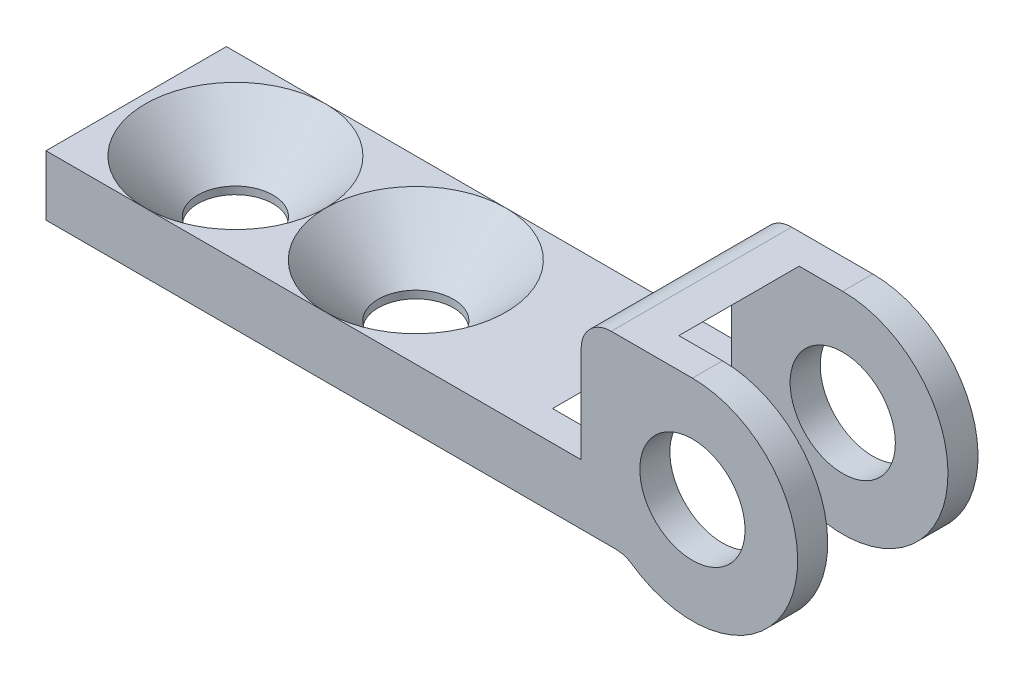
ISO-10303-21;
HEADER;
FILE_DESCRIPTION(('STEP AP214'),'2;1');
FILE_NAME('part.step','',(''),(''),'','','');
FILE_SCHEMA(('AUTOMOTIVE_DESIGN { 1 0 10303 214 1 1 1 1 }'));
ENDSEC;
DATA;
#1=APPLICATION_CONTEXT('core data for automotive mechanical design processes');
#2=APPLICATION_PROTOCOL_DEFINITION('international standard','automotive_design',2000,#1);
#3=PRODUCT_CONTEXT('',#1,'mechanical');
#4=PRODUCT('Part','Part','',(#3));
#5=PRODUCT_RELATED_PRODUCT_CATEGORY('part','',(#4));
#6=PRODUCT_DEFINITION_FORMATION('','',#4);
#7=PRODUCT_DEFINITION_CONTEXT('part definition',#1,'design');
#8=PRODUCT_DEFINITION('design','',#6,#7);
#9=PRODUCT_DEFINITION_SHAPE('','',#8);
#10=(LENGTH_UNIT() NAMED_UNIT(*) SI_UNIT(.MILLI.,.METRE.));
#11=(NAMED_UNIT(*) PLANE_ANGLE_UNIT() SI_UNIT($,.RADIAN.));
#12=(NAMED_UNIT(*) SI_UNIT($,.STERADIAN.) SOLID_ANGLE_UNIT());
#13=UNCERTAINTY_MEASURE_WITH_UNIT(LENGTH_MEASURE(1.E-05),#10,'distance_accuracy_value','');
#14=(GEOMETRIC_REPRESENTATION_CONTEXT(3) GLOBAL_UNCERTAINTY_ASSIGNED_CONTEXT((#13)) GLOBAL_UNIT_ASSIGNED_CONTEXT((#10,
#11,#12)) REPRESENTATION_CONTEXT('',''));
#15=CARTESIAN_POINT('',(0.,0.,0.));
#16=DIRECTION('',(0.,0.,1.));
#17=DIRECTION('',(1.,0.,0.));
#18=AXIS2_PLACEMENT_3D('',#15,#16,#17);
#19=CARTESIAN_POINT('',(0.86993036691125,6.15104880777221,1.5));
#20=DIRECTION('',(0.,0.,1.));
#21=DIRECTION('',(1.,0.,0.));
#22=AXIS2_PLACEMENT_3D('',#19,#20,#21);
#23=CYLINDRICAL_SURFACE('',#22,1.);
#24=CARTESIAN_POINT('',(0.86993036691125,6.15104880777221,-3.));
#25=DIRECTION('',(0.,0.,1.));
#26=DIRECTION('',(1.,0.,0.));
#27=AXIS2_PLACEMENT_3D('',#24,#25,#26);
#28=CIRCLE('',#27,1.);
#29=CARTESIAN_POINT('',(0.86993036691125,7.15104880777221,-3.));
#30=VERTEX_POINT('',#29);
#31=CARTESIAN_POINT('',(-0.13006963308875,6.15104880777221,-3.));
#32=VERTEX_POINT('',#31);
#33=EDGE_CURVE('E161',#30,#32,#28,.T.);
#34=ORIENTED_EDGE('',*,*,#33,.T.);
#35=DIRECTION('',(0.,0.,-1.));
#36=VECTOR('',#35,1.);
#37=CARTESIAN_POINT('',(-0.13006963308875,6.15104880777221,3.));
#38=LINE('',#37,#36);
#39=CARTESIAN_POINT('',(-0.13006963308875,6.15104880777221,3.));
#40=VERTEX_POINT('',#39);
#41=EDGE_CURVE('E159',#32,#40,#38,.F.);
#42=ORIENTED_EDGE('',*,*,#41,.T.);
#43=CARTESIAN_POINT('',(0.86993036691125,6.15104880777221,3.));
#44=DIRECTION('',(0.,0.,1.));
#45=DIRECTION('',(1.,0.,0.));
#46=AXIS2_PLACEMENT_3D('',#43,#44,#45);
#47=CIRCLE('',#46,1.);
#48=CARTESIAN_POINT('',(0.86993036691125,7.15104880777221,3.));
#49=VERTEX_POINT('',#48);
#50=EDGE_CURVE('E20',#40,#49,#47,.F.);
#51=ORIENTED_EDGE('',*,*,#50,.T.);
#52=DIRECTION('',(0.,0.,1.));
#53=VECTOR('',#52,1.);
#54=CARTESIAN_POINT('',(0.86993036691125,7.15104880777221,0.));
#55=LINE('',#54,#53);
#56=EDGE_CURVE('E156',#30,#49,#55,.T.);
#57=ORIENTED_EDGE('',*,*,#56,.F.);
#58=EDGE_LOOP('',(#34,#42,#51,#57));
#59=FACE_BOUND('',#58,.T.);
#60=ADVANCED_FACE('F17',(#59),#23,.T.);
#61=CARTESIAN_POINT('',(-4.49303683807458,1.55104880777221,-0.7));
#62=DIRECTION('',(0.,1.,0.));
#63=DIRECTION('',(-1.,0.,0.));
#64=AXIS2_PLACEMENT_3D('',#61,#62,#63);
#65=PLANE('',#64);
#66=DIRECTION('',(1.,0.,0.));
#67=VECTOR('',#66,1.);
#68=CARTESIAN_POINT('',(-2.525276673201,1.55104880777221,-0.4));
#69=LINE('',#68,#67);
#70=CARTESIAN_POINT('',(-3.47981710139458,1.55104880777221,-0.4));
#71=VERTEX_POINT('',#70);
#72=CARTESIAN_POINT('',(-6.27981710139458,1.55104880777221,-0.4));
#73=VERTEX_POINT('',#72);
#74=EDGE_CURVE('E218',#71,#73,#69,.F.);
#75=ORIENTED_EDGE('',*,*,#74,.T.);
#76=CARTESIAN_POINT('',(-6.27981710139458,1.55104880777221,-0.7));
#77=DIRECTION('',(0.,1.,0.));
#78=DIRECTION('',(0.,0.,1.));
#79=AXIS2_PLACEMENT_3D('',#76,#77,#78);
#80=CIRCLE('',#79,0.3);
#81=CARTESIAN_POINT('',(-6.27981710139458,1.55104880777221,-1.));
#82=VERTEX_POINT('',#81);
#83=EDGE_CURVE('E231',#73,#82,#80,.F.);
#84=ORIENTED_EDGE('',*,*,#83,.T.);
#85=DIRECTION('',(-1.,0.,0.));
#86=VECTOR('',#85,1.);
#87=CARTESIAN_POINT('',(-6.27981710139458,1.55104880777221,-1.));
#88=LINE('',#87,#86);
#89=CARTESIAN_POINT('',(-3.47981710139458,1.55104880777221,-1.));
#90=VERTEX_POINT('',#89);
#91=EDGE_CURVE('E232',#82,#90,#88,.F.);
#92=ORIENTED_EDGE('',*,*,#91,.T.);
#93=DIRECTION('',(0.,0.,1.));
#94=VECTOR('',#93,1.);
#95=CARTESIAN_POINT('',(-3.47981710139458,1.55104880777221,-0.7));
#96=LINE('',#95,#94);
#97=EDGE_CURVE('E310',#71,#90,#96,.F.);
#98=ORIENTED_EDGE('',*,*,#97,.F.);
#99=EDGE_LOOP('',(#75,#84,#92,#98));
#100=FACE_BOUND('',#99,.T.);
#101=ADVANCED_FACE('F658',(#100),#65,.F.);
#102=CARTESIAN_POINT('',(3.56993036691125,3.65104880777221,-1.));
#103=DIRECTION('',(0.,0.,1.));
#104=DIRECTION('',(1.,0.,0.));
#105=AXIS2_PLACEMENT_3D('',#102,#103,#104);
#106=CYLINDRICAL_SURFACE('',#105,1.75);
#107=CARTESIAN_POINT('',(3.56993036691125,3.65104880777221,3.));
#108=DIRECTION('',(0.,0.,1.));
#109=DIRECTION('',(1.,0.,0.));
#110=AXIS2_PLACEMENT_3D('',#107,#108,#109);
#111=CIRCLE('',#110,1.75);
#112=CARTESIAN_POINT('',(5.31993036691125,3.65104880777221,3.));
#113=VERTEX_POINT('',#112);
#114=EDGE_CURVE('E198',#113,#113,#111,.F.);
#115=ORIENTED_EDGE('',*,*,#114,.F.);
#116=EDGE_LOOP('',(#115));
#117=FACE_BOUND('',#116,.T.);
#118=CARTESIAN_POINT('',(3.56993036691125,3.65104880777221,2.));
#119=DIRECTION('',(0.,0.,1.));
#120=DIRECTION('',(1.,0.,0.));
#121=AXIS2_PLACEMENT_3D('',#118,#119,#120);
#122=CIRCLE('',#121,1.75);
#123=CARTESIAN_POINT('',(5.31993036691125,3.65104880777221,2.));
#124=VERTEX_POINT('',#123);
#125=EDGE_CURVE('E314',#124,#124,#122,.F.);
#126=ORIENTED_EDGE('',*,*,#125,.T.);
#127=EDGE_LOOP('',(#126));
#128=FACE_BOUND('',#127,.T.);
#129=ADVANCED_FACE('F545',(#117,#128),#106,.F.);
#130=CARTESIAN_POINT('',(-10.0300696330888,2.95104880777221,0.));
#131=DIRECTION('',(0.,1.,0.));
#132=DIRECTION('',(-1.,0.,0.));
#133=AXIS2_PLACEMENT_3D('',#130,#131,#132);
#134=PLANE('',#133);
#135=DIRECTION('',(1.,0.,0.));
#136=VECTOR('',#135,1.);
#137=CARTESIAN_POINT('',(1.86274959704036,2.95104880777221,3.));
#138=LINE('',#137,#136);
#139=CARTESIAN_POINT('',(-8.63006963308875,2.95104880775855,3.00000000003736));
#140=VERTEX_POINT('',#139);
#141=CARTESIAN_POINT('',(-14.6300696330888,2.95104880775855,3.00000000002305));
#142=VERTEX_POINT('',#141);
#143=EDGE_CURVE('E300',#140,#142,#138,.F.);
#144=ORIENTED_EDGE('',*,*,#143,.F.);
#145=CARTESIAN_POINT('',(-8.63006963308875,2.95104880774488,0.));
#146=DIRECTION('',(0.,1.,0.));
#147=DIRECTION('',(0.,0.,1.));
#148=AXIS2_PLACEMENT_3D('',#145,#146,#147);
#149=CIRCLE('',#148,3.00000000007471);
#150=CARTESIAN_POINT('',(-11.6300696331031,2.95104880774488,0.));
#151=VERTEX_POINT('',#150);
#152=EDGE_CURVE('E434',#140,#151,#149,.F.);
#153=ORIENTED_EDGE('',*,*,#152,.T.);
#154=CARTESIAN_POINT('',(-14.6300696330888,2.95104880774488,0.));
#155=DIRECTION('',(0.,1.,0.));
#156=DIRECTION('',(0.,0.,1.));
#157=AXIS2_PLACEMENT_3D('',#154,#155,#156);
#158=CIRCLE('',#157,3.0000000000461);
#159=EDGE_CURVE('E437',#151,#142,#158,.F.);
#160=ORIENTED_EDGE('',*,*,#159,.T.);
#161=EDGE_LOOP('',(#144,#153,#160));
#162=FACE_BOUND('',#161,.T.);
#163=ADVANCED_FACE('F535',(#162),#134,.T.);
#164=CARTESIAN_POINT('',(1.01047639878953,-0.0501936032387196,0.));
#165=DIRECTION('',(0.,0.,1.));
#166=DIRECTION('',(1.,0.,0.));
#167=AXIS2_PLACEMENT_3D('',#164,#165,#166);
#168=CYLINDRICAL_SURFACE('',#167,1.);
#169=DIRECTION('',(0.,0.,1.));
#170=VECTOR('',#169,1.);
#171=CARTESIAN_POINT('',(1.57924394726102,0.772304710319267,0.));
#172=LINE('',#171,#170);
#173=CARTESIAN_POINT('',(1.57924394726102,0.772304710319266,3.));
#174=VERTEX_POINT('',#173);
#175=CARTESIAN_POINT('',(1.57924394726102,0.772304710319266,2.));
#176=VERTEX_POINT('',#175);
#177=EDGE_CURVE('E171',#174,#176,#172,.F.);
#178=ORIENTED_EDGE('',*,*,#177,.F.);
#179=CARTESIAN_POINT('',(1.01047639878953,-0.0501936032387196,3.));
#180=DIRECTION('',(0.,0.,1.));
#181=DIRECTION('',(1.,0.,0.));
#182=AXIS2_PLACEMENT_3D('',#179,#180,#181);
#183=CIRCLE('',#182,1.);
#184=CARTESIAN_POINT('',(1.01179641786448,0.949805525535722,3.));
#185=VERTEX_POINT('',#184);
#186=EDGE_CURVE('E183',#185,#174,#183,.F.);
#187=ORIENTED_EDGE('',*,*,#186,.F.);
#188=DIRECTION('',(0.,0.,1.));
#189=VECTOR('',#188,1.);
#190=CARTESIAN_POINT('',(1.01179641786448,0.949805525535722,0.));
#191=LINE('',#190,#189);
#192=CARTESIAN_POINT('',(1.01179641786448,0.949805525535722,2.));
#193=VERTEX_POINT('',#192);
#194=EDGE_CURVE('E311',#193,#185,#191,.T.);
#195=ORIENTED_EDGE('',*,*,#194,.F.);
#196=CARTESIAN_POINT('',(1.01047639878953,-0.0501936032387196,2.));
#197=DIRECTION('',(0.,0.,1.));
#198=DIRECTION('',(1.,0.,0.));
#199=AXIS2_PLACEMENT_3D('',#196,#197,#198);
#200=CIRCLE('',#199,1.);
#201=EDGE_CURVE('E210',#193,#176,#200,.F.);
#202=ORIENTED_EDGE('',*,*,#201,.T.);
#203=EDGE_LOOP('',(#178,#187,#195,#202));
#204=FACE_BOUND('',#203,.T.);
#205=ADVANCED_FACE('F533',(#204),#168,.F.);
#206=CARTESIAN_POINT('',(3.56993036691125,3.65104880777221,0.));
#207=DIRECTION('',(0.,0.,1.));
#208=DIRECTION('',(1.,0.,0.));
#209=AXIS2_PLACEMENT_3D('',#206,#207,#208);
#210=CYLINDRICAL_SURFACE('',#209,3.5);
#211=DIRECTION('',(0.,0.,1.));
#212=VECTOR('',#211,1.);
#213=CARTESIAN_POINT('',(3.56993036691125,7.15104880777221,0.));
#214=LINE('',#213,#212);
#215=CARTESIAN_POINT('',(3.56993036691125,7.15104880777221,3.));
#216=VERTEX_POINT('',#215);
#217=CARTESIAN_POINT('',(3.56993036691125,7.15104880777221,2.));
#218=VERTEX_POINT('',#217);
#219=EDGE_CURVE('E170',#216,#218,#214,.F.);
#220=ORIENTED_EDGE('',*,*,#219,.F.);
#221=CARTESIAN_POINT('',(3.56993036691125,3.65104880777221,3.));
#222=DIRECTION('',(0.,0.,1.));
#223=DIRECTION('',(1.,0.,0.));
#224=AXIS2_PLACEMENT_3D('',#221,#222,#223);
#225=CIRCLE('',#224,3.5);
#226=EDGE_CURVE('E177',#174,#216,#225,.T.);
#227=ORIENTED_EDGE('',*,*,#226,.F.);
#228=ORIENTED_EDGE('',*,*,#177,.T.);
#229=CARTESIAN_POINT('',(3.56993036691125,3.65104880777221,2.));
#230=DIRECTION('',(0.,0.,1.));
#231=DIRECTION('',(1.,0.,0.));
#232=AXIS2_PLACEMENT_3D('',#229,#230,#231);
#233=CIRCLE('',#232,3.5);
#234=EDGE_CURVE('E204',#176,#218,#233,.T.);
#235=ORIENTED_EDGE('',*,*,#234,.T.);
#236=EDGE_LOOP('',(#220,#227,#228,#235));
#237=FACE_BOUND('',#236,.T.);
#238=ADVANCED_FACE('F530',(#237),#210,.T.);
#239=CARTESIAN_POINT('',(-10.0300696330888,2.95104880777221,0.));
#240=DIRECTION('',(0.,1.,0.));
#241=DIRECTION('',(-1.,0.,0.));
#242=AXIS2_PLACEMENT_3D('',#239,#240,#241);
#243=PLANE('',#242);
#244=CARTESIAN_POINT('',(-8.63006963308875,2.95104880774488,0.));
#245=DIRECTION('',(0.,1.,0.));
#246=DIRECTION('',(0.,0.,1.));
#247=AXIS2_PLACEMENT_3D('',#244,#245,#246);
#248=CIRCLE('',#247,3.00000000007471);
#249=CARTESIAN_POINT('',(-8.63006963308875,2.95104880775855,-3.00000000003736));
#250=VERTEX_POINT('',#249);
#251=EDGE_CURVE('E432',#151,#250,#248,.F.);
#252=ORIENTED_EDGE('',*,*,#251,.T.);
#253=DIRECTION('',(1.,0.,0.));
#254=VECTOR('',#253,1.);
#255=CARTESIAN_POINT('',(1.86274959704036,2.95104880777221,-3.));
#256=LINE('',#255,#254);
#257=CARTESIAN_POINT('',(-14.6300696330888,2.95104880775855,-3.00000000002305));
#258=VERTEX_POINT('',#257);
#259=EDGE_CURVE('E271',#250,#258,#256,.F.);
#260=ORIENTED_EDGE('',*,*,#259,.T.);
#261=CARTESIAN_POINT('',(-14.6300696330888,2.95104880774488,0.));
#262=DIRECTION('',(0.,1.,0.));
#263=DIRECTION('',(0.,0.,1.));
#264=AXIS2_PLACEMENT_3D('',#261,#262,#263);
#265=CIRCLE('',#264,3.0000000000461);
#266=EDGE_CURVE('E439',#258,#151,#265,.F.);
#267=ORIENTED_EDGE('',*,*,#266,.T.);
#268=EDGE_LOOP('',(#252,#260,#267));
#269=FACE_BOUND('',#268,.T.);
#270=ADVANCED_FACE('F543',(#269),#243,.T.);
#271=CARTESIAN_POINT('',(-10.0300696330888,2.95104880777221,0.));
#272=DIRECTION('',(0.,1.,0.));
#273=DIRECTION('',(-1.,0.,0.));
#274=AXIS2_PLACEMENT_3D('',#271,#272,#273);
#275=PLANE('',#274);
#276=DIRECTION('',(0.,0.,1.));
#277=VECTOR('',#276,1.);
#278=CARTESIAN_POINT('',(-17.9300696330888,2.95104880777221,0.));
#279=LINE('',#278,#277);
#280=CARTESIAN_POINT('',(-17.9300696330888,2.95104880777221,3.));
#281=VERTEX_POINT('',#280);
#282=CARTESIAN_POINT('',(-17.9300696330888,2.95104880777221,-3.));
#283=VERTEX_POINT('',#282);
#284=EDGE_CURVE('E178',#281,#283,#279,.F.);
#285=ORIENTED_EDGE('',*,*,#284,.F.);
#286=DIRECTION('',(1.,0.,0.));
#287=VECTOR('',#286,1.);
#288=CARTESIAN_POINT('',(1.86274959704036,2.95104880777221,3.));
#289=LINE('',#288,#287);
#290=EDGE_CURVE('E192',#142,#281,#289,.F.);
#291=ORIENTED_EDGE('',*,*,#290,.F.);
#292=CARTESIAN_POINT('',(-14.6300696330888,2.95104880774488,0.));
#293=DIRECTION('',(0.,1.,0.));
#294=DIRECTION('',(0.,0.,1.));
#295=AXIS2_PLACEMENT_3D('',#292,#293,#294);
#296=CIRCLE('',#295,3.0000000000461);
#297=EDGE_CURVE('E294',#142,#258,#296,.F.);
#298=ORIENTED_EDGE('',*,*,#297,.T.);
#299=DIRECTION('',(1.,0.,0.));
#300=VECTOR('',#299,1.);
#301=CARTESIAN_POINT('',(1.86274959704036,2.95104880777221,-3.));
#302=LINE('',#301,#300);
#303=EDGE_CURVE('E274',#258,#283,#302,.F.);
#304=ORIENTED_EDGE('',*,*,#303,.T.);
#305=EDGE_LOOP('',(#285,#291,#298,#304));
#306=FACE_BOUND('',#305,.T.);
#307=ADVANCED_FACE('F626',(#306),#275,.T.);
#308=CARTESIAN_POINT('',(2.12018289860541,7.15104880777221,0.));
#309=DIRECTION('',(0.,1.,0.));
#310=DIRECTION('',(0.,0.,1.));
#311=AXIS2_PLACEMENT_3D('',#308,#309,#310);
#312=PLANE('',#311);
#313=DIRECTION('',(0.,0.,1.));
#314=VECTOR('',#313,1.);
#315=CARTESIAN_POINT('',(3.56993036691125,7.15104880777221,0.));
#316=LINE('',#315,#314);
#317=CARTESIAN_POINT('',(3.56993036691125,7.15104880777221,-3.));
#318=VERTEX_POINT('',#317);
#319=CARTESIAN_POINT('',(3.56993036691125,7.15104880777221,-2.));
#320=VERTEX_POINT('',#319);
#321=EDGE_CURVE('E238',#318,#320,#316,.T.);
#322=ORIENTED_EDGE('',*,*,#321,.F.);
#323=DIRECTION('',(1.,0.,0.));
#324=VECTOR('',#323,1.);
#325=CARTESIAN_POINT('',(1.86274959704036,7.15104880777221,-3.));
#326=LINE('',#325,#324);
#327=EDGE_CURVE('E169',#318,#30,#326,.F.);
#328=ORIENTED_EDGE('',*,*,#327,.T.);
#329=ORIENTED_EDGE('',*,*,#56,.T.);
#330=DIRECTION('',(1.,0.,0.));
#331=VECTOR('',#330,1.);
#332=CARTESIAN_POINT('',(1.86274959704036,7.15104880777221,3.));
#333=LINE('',#332,#331);
#334=EDGE_CURVE('E166',#216,#49,#333,.F.);
#335=ORIENTED_EDGE('',*,*,#334,.F.);
#336=ORIENTED_EDGE('',*,*,#219,.T.);
#337=DIRECTION('',(1.,0.,0.));
#338=VECTOR('',#337,1.);
#339=CARTESIAN_POINT('',(1.86274959704036,7.15104880777221,2.));
#340=LINE('',#339,#338);
#341=CARTESIAN_POINT('',(2.12018289860541,7.15104880777221,2.));
#342=VERTEX_POINT('',#341);
#343=EDGE_CURVE('E201',#218,#342,#340,.F.);
#344=ORIENTED_EDGE('',*,*,#343,.T.);
#345=DIRECTION('',(0.,0.,1.));
#346=VECTOR('',#345,1.);
#347=CARTESIAN_POINT('',(2.12018289860541,7.15104880777221,0.));
#348=LINE('',#347,#346);
#349=CARTESIAN_POINT('',(2.12018289860541,7.15104880777221,-2.));
#350=VERTEX_POINT('',#349);
#351=EDGE_CURVE('E241',#342,#350,#348,.F.);
#352=ORIENTED_EDGE('',*,*,#351,.T.);
#353=DIRECTION('',(1.,0.,0.));
#354=VECTOR('',#353,1.);
#355=CARTESIAN_POINT('',(2.12018289860541,7.15104880777221,-2.));
#356=LINE('',#355,#354);
#357=EDGE_CURVE('E245',#350,#320,#356,.T.);
#358=ORIENTED_EDGE('',*,*,#357,.T.);
#359=EDGE_LOOP('',(#322,#328,#329,#335,#336,#344,#352,#358));
#360=FACE_BOUND('',#359,.T.);
#361=ADVANCED_FACE('F164',(#360),#312,.T.);
#362=CARTESIAN_POINT('',(-10.0300696330888,2.95104880777221,0.));
#363=DIRECTION('',(0.,1.,0.));
#364=DIRECTION('',(-1.,0.,0.));
#365=AXIS2_PLACEMENT_3D('',#362,#363,#364);
#366=PLANE('',#365);
#367=DIRECTION('',(0.,0.,-1.));
#368=VECTOR('',#367,1.);
#369=CARTESIAN_POINT('',(-0.13006963308875,2.95104880777221,3.));
#370=LINE('',#369,#368);
#371=CARTESIAN_POINT('',(-0.13006963308875,2.95104880777221,-2.));
#372=VERTEX_POINT('',#371);
#373=CARTESIAN_POINT('',(-0.13006963308875,2.95104880777221,-3.));
#374=VERTEX_POINT('',#373);
#375=EDGE_CURVE('E236',#372,#374,#370,.T.);
#376=ORIENTED_EDGE('',*,*,#375,.T.);
#377=DIRECTION('',(1.,0.,0.));
#378=VECTOR('',#377,1.);
#379=CARTESIAN_POINT('',(1.86274959704036,2.95104880777221,-3.));
#380=LINE('',#379,#378);
#381=EDGE_CURVE('E275',#374,#250,#380,.F.);
#382=ORIENTED_EDGE('',*,*,#381,.T.);
#383=CARTESIAN_POINT('',(-8.63006963308875,2.95104880774488,0.));
#384=DIRECTION('',(0.,1.,0.));
#385=DIRECTION('',(0.,0.,1.));
#386=AXIS2_PLACEMENT_3D('',#383,#384,#385);
#387=CIRCLE('',#386,3.00000000007471);
#388=EDGE_CURVE('E360',#250,#140,#387,.F.);
#389=ORIENTED_EDGE('',*,*,#388,.T.);
#390=DIRECTION('',(1.,0.,0.));
#391=VECTOR('',#390,1.);
#392=CARTESIAN_POINT('',(1.86274959704036,2.95104880777221,3.));
#393=LINE('',#392,#391);
#394=CARTESIAN_POINT('',(-0.13006963308875,2.95104880777221,3.));
#395=VERTEX_POINT('',#394);
#396=EDGE_CURVE('E197',#395,#140,#393,.F.);
#397=ORIENTED_EDGE('',*,*,#396,.F.);
#398=DIRECTION('',(0.,0.,-1.));
#399=VECTOR('',#398,1.);
#400=CARTESIAN_POINT('',(-0.13006963308875,2.95104880777221,3.));
#401=LINE('',#400,#399);
#402=CARTESIAN_POINT('',(-0.13006963308875,2.95104880777221,2.));
#403=VERTEX_POINT('',#402);
#404=EDGE_CURVE('E237',#395,#403,#401,.T.);
#405=ORIENTED_EDGE('',*,*,#404,.T.);
#406=DIRECTION('',(1.,0.,0.));
#407=VECTOR('',#406,1.);
#408=CARTESIAN_POINT('',(1.86274959704036,2.95104880777221,2.));
#409=LINE('',#408,#407);
#410=CARTESIAN_POINT('',(-2.07981710139458,2.95104880777221,2.));
#411=VERTEX_POINT('',#410);
#412=EDGE_CURVE('E387',#403,#411,#409,.F.);
#413=ORIENTED_EDGE('',*,*,#412,.T.);
#414=DIRECTION('',(0.,0.,1.));
#415=VECTOR('',#414,1.);
#416=CARTESIAN_POINT('',(-2.07981710139458,2.95104880777222,0.));
#417=LINE('',#416,#415);
#418=CARTESIAN_POINT('',(-2.07981710139458,2.95104880777221,-2.));
#419=VERTEX_POINT('',#418);
#420=EDGE_CURVE('E212',#411,#419,#417,.F.);
#421=ORIENTED_EDGE('',*,*,#420,.T.);
#422=DIRECTION('',(1.,0.,0.));
#423=VECTOR('',#422,1.);
#424=CARTESIAN_POINT('',(1.86274959704036,2.95104880777221,-2.));
#425=LINE('',#424,#423);
#426=EDGE_CURVE('E263',#372,#419,#425,.F.);
#427=ORIENTED_EDGE('',*,*,#426,.F.);
#428=EDGE_LOOP('',(#376,#382,#389,#397,#405,#413,#421,#427));
#429=FACE_BOUND('',#428,.T.);
#430=ADVANCED_FACE('F520',(#429),#366,.T.);
#431=CARTESIAN_POINT('',(1.01047639878953,-0.0501936032387196,0.));
#432=DIRECTION('',(0.,0.,1.));
#433=DIRECTION('',(1.,0.,0.));
#434=AXIS2_PLACEMENT_3D('',#431,#432,#433);
#435=CYLINDRICAL_SURFACE('',#434,1.);
#436=DIRECTION('',(0.,0.,1.));
#437=VECTOR('',#436,1.);
#438=CARTESIAN_POINT('',(1.57924394726102,0.772304710319267,0.));
#439=LINE('',#438,#437);
#440=CARTESIAN_POINT('',(1.57924394726102,0.772304710319266,-2.));
#441=VERTEX_POINT('',#440);
#442=CARTESIAN_POINT('',(1.57924394726102,0.772304710319266,-3.));
#443=VERTEX_POINT('',#442);
#444=EDGE_CURVE('E242',#441,#443,#439,.F.);
#445=ORIENTED_EDGE('',*,*,#444,.F.);
#446=CARTESIAN_POINT('',(1.01047639878953,-0.0501936032387196,-2.));
#447=DIRECTION('',(0.,0.,1.));
#448=DIRECTION('',(1.,0.,0.));
#449=AXIS2_PLACEMENT_3D('',#446,#447,#448);
#450=CIRCLE('',#449,1.);
#451=CARTESIAN_POINT('',(1.01179641786448,0.949805525535722,-2.));
#452=VERTEX_POINT('',#451);
#453=EDGE_CURVE('E413',#452,#441,#450,.F.);
#454=ORIENTED_EDGE('',*,*,#453,.F.);
#455=DIRECTION('',(0.,0.,1.));
#456=VECTOR('',#455,1.);
#457=CARTESIAN_POINT('',(1.01179641786448,0.949805525535722,0.));
#458=LINE('',#457,#456);
#459=CARTESIAN_POINT('',(1.01179641786448,0.949805525535722,-3.));
#460=VERTEX_POINT('',#459);
#461=EDGE_CURVE('E246',#460,#452,#458,.T.);
#462=ORIENTED_EDGE('',*,*,#461,.F.);
#463=CARTESIAN_POINT('',(1.01047639878953,-0.0501936032387196,-3.));
#464=DIRECTION('',(0.,0.,1.));
#465=DIRECTION('',(1.,0.,0.));
#466=AXIS2_PLACEMENT_3D('',#463,#464,#465);
#467=CIRCLE('',#466,1.);
#468=EDGE_CURVE('E285',#460,#443,#467,.F.);
#469=ORIENTED_EDGE('',*,*,#468,.T.);
#470=EDGE_LOOP('',(#445,#454,#462,#469));
#471=FACE_BOUND('',#470,.T.);
#472=ADVANCED_FACE('F617',(#471),#435,.F.);
#473=CARTESIAN_POINT('',(3.56993036691125,3.65104880777221,0.));
#474=DIRECTION('',(0.,0.,1.));
#475=DIRECTION('',(1.,0.,0.));
#476=AXIS2_PLACEMENT_3D('',#473,#474,#475);
#477=CYLINDRICAL_SURFACE('',#476,3.5);
#478=ORIENTED_EDGE('',*,*,#321,.T.);
#479=CARTESIAN_POINT('',(3.56993036691125,3.65104880777221,-2.));
#480=DIRECTION('',(0.,0.,1.));
#481=DIRECTION('',(1.,0.,0.));
#482=AXIS2_PLACEMENT_3D('',#479,#480,#481);
#483=CIRCLE('',#482,3.5);
#484=EDGE_CURVE('E399',#441,#320,#483,.T.);
#485=ORIENTED_EDGE('',*,*,#484,.F.);
#486=ORIENTED_EDGE('',*,*,#444,.T.);
#487=CARTESIAN_POINT('',(3.56993036691125,3.65104880777221,-3.));
#488=DIRECTION('',(0.,0.,1.));
#489=DIRECTION('',(1.,0.,0.));
#490=AXIS2_PLACEMENT_3D('',#487,#488,#489);
#491=CIRCLE('',#490,3.5);
#492=EDGE_CURVE('E418',#443,#318,#491,.T.);
#493=ORIENTED_EDGE('',*,*,#492,.T.);
#494=EDGE_LOOP('',(#478,#485,#486,#493));
#495=FACE_BOUND('',#494,.T.);
#496=ADVANCED_FACE('F614',(#495),#477,.T.);
#497=CARTESIAN_POINT('',(2.12018289860541,7.15104880777221,0.));
#498=DIRECTION('',(-0.707106781186548,0.707106781186547,0.));
#499=DIRECTION('',(-0.707106781186547,-0.707106781186548,0.));
#500=AXIS2_PLACEMENT_3D('',#497,#498,#499);
#501=PLANE('',#500);
#502=DIRECTION('',(-0.707106781186546,-0.707106781186549,0.));
#503=VECTOR('',#502,1.);
#504=CARTESIAN_POINT('',(2.12018289860541,7.15104880777221,-2.));
#505=LINE('',#504,#503);
#506=CARTESIAN_POINT('',(-0.130069633088752,4.90079627607804,-2.));
#507=VERTEX_POINT('',#506);
#508=EDGE_CURVE('E382',#350,#507,#505,.T.);
#509=ORIENTED_EDGE('',*,*,#508,.F.);
#510=ORIENTED_EDGE('',*,*,#351,.F.);
#511=DIRECTION('',(-0.707106781186546,-0.707106781186549,0.));
#512=VECTOR('',#511,1.);
#513=CARTESIAN_POINT('',(2.12018289860541,7.15104880777221,2.));
#514=LINE('',#513,#512);
#515=CARTESIAN_POINT('',(-0.130069633088752,4.90079627607804,2.));
#516=VERTEX_POINT('',#515);
#517=EDGE_CURVE('E203',#342,#516,#514,.T.);
#518=ORIENTED_EDGE('',*,*,#517,.T.);
#519=DIRECTION('',(0.,0.,-1.));
#520=VECTOR('',#519,1.);
#521=CARTESIAN_POINT('',(-0.13006963308875,4.90079627607804,3.));
#522=LINE('',#521,#520);
#523=EDGE_CURVE('E233',#516,#507,#522,.T.);
#524=ORIENTED_EDGE('',*,*,#523,.T.);
#525=EDGE_LOOP('',(#509,#510,#518,#524));
#526=FACE_BOUND('',#525,.T.);
#527=ADVANCED_FACE('F526',(#526),#501,.F.);
#528=CARTESIAN_POINT('',(-0.13006963308875,7.15104880777221,3.));
#529=DIRECTION('',(1.,0.,0.));
#530=DIRECTION('',(0.,0.,-1.));
#531=AXIS2_PLACEMENT_3D('',#528,#529,#530);
#532=PLANE('',#531);
#533=DIRECTION('',(0.,1.,0.));
#534=VECTOR('',#533,1.);
#535=CARTESIAN_POINT('',(-0.13006963308875,3.21824159222137,-3.));
#536=LINE('',#535,#534);
#537=EDGE_CURVE('E290',#32,#374,#536,.F.);
#538=ORIENTED_EDGE('',*,*,#537,.T.);
#539=ORIENTED_EDGE('',*,*,#375,.F.);
#540=DIRECTION('',(0.,1.,0.));
#541=VECTOR('',#540,1.);
#542=CARTESIAN_POINT('',(-0.13006963308875,3.21824159222137,-2.));
#543=LINE('',#542,#541);
#544=EDGE_CURVE('E378',#507,#372,#543,.F.);
#545=ORIENTED_EDGE('',*,*,#544,.F.);
#546=ORIENTED_EDGE('',*,*,#523,.F.);
#547=DIRECTION('',(0.,1.,0.));
#548=VECTOR('',#547,1.);
#549=CARTESIAN_POINT('',(-0.13006963308875,3.21824159222138,2.));
#550=LINE('',#549,#548);
#551=EDGE_CURVE('E348',#516,#403,#550,.F.);
#552=ORIENTED_EDGE('',*,*,#551,.T.);
#553=ORIENTED_EDGE('',*,*,#404,.F.);
#554=DIRECTION('',(0.,1.,0.));
#555=VECTOR('',#554,1.);
#556=CARTESIAN_POINT('',(-0.13006963308875,3.21824159222138,3.));
#557=LINE('',#556,#555);
#558=EDGE_CURVE('E195',#40,#395,#557,.F.);
#559=ORIENTED_EDGE('',*,*,#558,.F.);
#560=ORIENTED_EDGE('',*,*,#41,.F.);
#561=EDGE_LOOP('',(#538,#539,#545,#546,#552,#553,#559,#560));
#562=FACE_BOUND('',#561,.T.);
#563=ADVANCED_FACE('F445',(#562),#532,.F.);
#564=CARTESIAN_POINT('',(3.56993036691125,3.65104880777221,-1.));
#565=DIRECTION('',(0.,0.,1.));
#566=DIRECTION('',(1.,0.,0.));
#567=AXIS2_PLACEMENT_3D('',#564,#565,#566);
#568=CYLINDRICAL_SURFACE('',#567,1.75);
#569=CARTESIAN_POINT('',(3.56993036691125,3.65104880777221,-2.));
#570=DIRECTION('',(0.,0.,1.));
#571=DIRECTION('',(1.,0.,0.));
#572=AXIS2_PLACEMENT_3D('',#569,#570,#571);
#573=CIRCLE('',#572,1.75);
#574=CARTESIAN_POINT('',(5.31993036691125,3.65104880777221,-2.));
#575=VERTEX_POINT('',#574);
#576=EDGE_CURVE('E381',#575,#575,#573,.F.);
#577=ORIENTED_EDGE('',*,*,#576,.F.);
#578=EDGE_LOOP('',(#577));
#579=FACE_BOUND('',#578,.T.);
#580=CARTESIAN_POINT('',(3.56993036691125,3.65104880777221,-3.));
#581=DIRECTION('',(0.,0.,1.));
#582=DIRECTION('',(1.,0.,0.));
#583=AXIS2_PLACEMENT_3D('',#580,#581,#582);
#584=CIRCLE('',#583,1.75);
#585=CARTESIAN_POINT('',(5.31993036691125,3.65104880777221,-3.));
#586=VERTEX_POINT('',#585);
#587=EDGE_CURVE('E249',#586,#586,#584,.F.);
#588=ORIENTED_EDGE('',*,*,#587,.T.);
#589=EDGE_LOOP('',(#588));
#590=FACE_BOUND('',#589,.T.);
#591=ADVANCED_FACE('F605',(#579,#590),#568,.F.);
#592=CARTESIAN_POINT('',(-14.6300696330888,2.95104880763119,0.));
#593=DIRECTION('',(0.,1.,0.));
#594=DIRECTION('',(0.,0.,1.));
#595=AXIS2_PLACEMENT_3D('',#592,#593,#594);
#596=CONICAL_SURFACE('',#595,2.99999999993242,0.785398163397448);
#597=CARTESIAN_POINT('',(-14.6300696330888,1.20104880777221,0.));
#598=DIRECTION('',(0.,1.,0.));
#599=DIRECTION('',(-1.,0.,0.));
#600=AXIS2_PLACEMENT_3D('',#597,#598,#599);
#601=CIRCLE('',#600,1.25);
#602=CARTESIAN_POINT('',(-15.8800696330888,1.20104880777221,0.));
#603=VERTEX_POINT('',#602);
#604=EDGE_CURVE('E410',#603,#603,#601,.F.);
#605=ORIENTED_EDGE('',*,*,#604,.T.);
#606=EDGE_LOOP('',(#605));
#607=FACE_BOUND('',#606,.T.);
#608=ORIENTED_EDGE('',*,*,#266,.F.);
#609=ORIENTED_EDGE('',*,*,#297,.F.);
#610=ORIENTED_EDGE('',*,*,#159,.F.);
#611=EDGE_LOOP('',(#608,#609,#610));
#612=FACE_BOUND('',#611,.T.);
#613=ADVANCED_FACE('F601',(#607,#612),#596,.F.);
#614=CARTESIAN_POINT('',(-8.63006963308875,2.95104880763119,0.));
#615=DIRECTION('',(0.,1.,0.));
#616=DIRECTION('',(0.,0.,1.));
#617=AXIS2_PLACEMENT_3D('',#614,#615,#616);
#618=CONICAL_SURFACE('',#617,2.99999999996102,0.785398163397448);
#619=CARTESIAN_POINT('',(-8.63006963308875,1.20104880777221,0.));
#620=DIRECTION('',(0.,1.,0.));
#621=DIRECTION('',(-1.,0.,0.));
#622=AXIS2_PLACEMENT_3D('',#619,#620,#621);
#623=CIRCLE('',#622,1.25);
#624=CARTESIAN_POINT('',(-9.88006963308875,1.20104880777221,0.));
#625=VERTEX_POINT('',#624);
#626=EDGE_CURVE('E460',#625,#625,#623,.F.);
#627=ORIENTED_EDGE('',*,*,#626,.T.);
#628=EDGE_LOOP('',(#627));
#629=FACE_BOUND('',#628,.T.);
#630=ORIENTED_EDGE('',*,*,#251,.F.);
#631=ORIENTED_EDGE('',*,*,#152,.F.);
#632=ORIENTED_EDGE('',*,*,#388,.F.);
#633=EDGE_LOOP('',(#630,#631,#632));
#634=FACE_BOUND('',#633,.T.);
#635=ADVANCED_FACE('F597',(#629,#634),#618,.F.);
#636=CARTESIAN_POINT('',(-6.27981710139458,0.951048807772208,-1.));
#637=DIRECTION('',(0.,0.,-1.));
#638=DIRECTION('',(-1.,0.,0.));
#639=AXIS2_PLACEMENT_3D('',#636,#637,#638);
#640=PLANE('',#639);
#641=ORIENTED_EDGE('',*,*,#91,.F.);
#642=DIRECTION('',(0.,1.,0.));
#643=VECTOR('',#642,1.);
#644=CARTESIAN_POINT('',(-6.27981710139458,0.951048807772208,-1.));
#645=LINE('',#644,#643);
#646=CARTESIAN_POINT('',(-6.27981710139458,0.951048807772208,-1.));
#647=VERTEX_POINT('',#646);
#648=EDGE_CURVE('E229',#82,#647,#645,.F.);
#649=ORIENTED_EDGE('',*,*,#648,.T.);
#650=DIRECTION('',(1.,0.,0.));
#651=VECTOR('',#650,1.);
#652=CARTESIAN_POINT('',(0.0699303669112483,0.951048807772209,-1.));
#653=LINE('',#652,#651);
#654=CARTESIAN_POINT('',(-4.07981710139458,0.951048807772209,-1.));
#655=VERTEX_POINT('',#654);
#656=EDGE_CURVE('E407',#655,#647,#653,.F.);
#657=ORIENTED_EDGE('',*,*,#656,.F.);
#658=DIRECTION('',(-0.707106781186547,-0.707106781186548,0.));
#659=VECTOR('',#658,1.);
#660=CARTESIAN_POINT('',(2.12018289860541,7.15104880777221,-1.));
#661=LINE('',#660,#659);
#662=EDGE_CURVE('E211',#655,#90,#661,.F.);
#663=ORIENTED_EDGE('',*,*,#662,.T.);
#664=EDGE_LOOP('',(#641,#649,#657,#663));
#665=FACE_BOUND('',#664,.T.);
#666=ADVANCED_FACE('F593',(#665),#640,.F.);
#667=CARTESIAN_POINT('',(-6.27981710139458,0.951048807772208,-0.7));
#668=DIRECTION('',(0.,1.,0.));
#669=DIRECTION('',(0.,0.,1.));
#670=AXIS2_PLACEMENT_3D('',#667,#668,#669);
#671=CYLINDRICAL_SURFACE('',#670,0.3);
#672=DIRECTION('',(0.,1.,0.));
#673=VECTOR('',#672,1.);
#674=CARTESIAN_POINT('',(-6.27981710139458,0.951048807772209,-0.4));
#675=LINE('',#674,#673);
#676=CARTESIAN_POINT('',(-6.27981710139458,0.951048807772208,-0.4));
#677=VERTEX_POINT('',#676);
#678=EDGE_CURVE('E216',#73,#677,#675,.F.);
#679=ORIENTED_EDGE('',*,*,#678,.T.);
#680=CARTESIAN_POINT('',(-6.27981710139458,0.951048807772208,-0.7));
#681=DIRECTION('',(0.,1.,0.));
#682=DIRECTION('',(0.,0.,1.));
#683=AXIS2_PLACEMENT_3D('',#680,#681,#682);
#684=CIRCLE('',#683,0.3);
#685=EDGE_CURVE('E404',#647,#677,#684,.T.);
#686=ORIENTED_EDGE('',*,*,#685,.F.);
#687=ORIENTED_EDGE('',*,*,#648,.F.);
#688=ORIENTED_EDGE('',*,*,#83,.F.);
#689=EDGE_LOOP('',(#679,#686,#687,#688));
#690=FACE_BOUND('',#689,.T.);
#691=ADVANCED_FACE('F589',(#690),#671,.F.);
#692=CARTESIAN_POINT('',(-2.525276673201,0.951048807772209,-0.4));
#693=DIRECTION('',(0.,0.,1.));
#694=DIRECTION('',(1.,0.,0.));
#695=AXIS2_PLACEMENT_3D('',#692,#693,#694);
#696=PLANE('',#695);
#697=DIRECTION('',(1.,0.,0.));
#698=VECTOR('',#697,1.);
#699=CARTESIAN_POINT('',(0.0699303669112483,0.951048807772209,-0.4));
#700=LINE('',#699,#698);
#701=CARTESIAN_POINT('',(-4.07981710139458,0.951048807772209,-0.4));
#702=VERTEX_POINT('',#701);
#703=EDGE_CURVE('E223',#677,#702,#700,.T.);
#704=ORIENTED_EDGE('',*,*,#703,.F.);
#705=ORIENTED_EDGE('',*,*,#678,.F.);
#706=ORIENTED_EDGE('',*,*,#74,.F.);
#707=DIRECTION('',(-0.707106781186547,-0.707106781186548,0.));
#708=VECTOR('',#707,1.);
#709=CARTESIAN_POINT('',(2.12018289860541,7.15104880777221,-0.4));
#710=LINE('',#709,#708);
#711=EDGE_CURVE('E215',#71,#702,#710,.T.);
#712=ORIENTED_EDGE('',*,*,#711,.T.);
#713=EDGE_LOOP('',(#704,#705,#706,#712));
#714=FACE_BOUND('',#713,.T.);
#715=ADVANCED_FACE('F586',(#714),#696,.F.);
#716=CARTESIAN_POINT('',(2.12018289860541,7.15104880777221,0.));
#717=DIRECTION('',(-0.707106781186548,0.707106781186547,0.));
#718=DIRECTION('',(-0.707106781186547,-0.707106781186548,0.));
#719=AXIS2_PLACEMENT_3D('',#716,#717,#718);
#720=PLANE('',#719);
#721=DIRECTION('',(0.,0.,1.));
#722=VECTOR('',#721,1.);
#723=CARTESIAN_POINT('',(-4.07981710139458,0.95104880777221,0.));
#724=LINE('',#723,#722);
#725=CARTESIAN_POINT('',(-4.07981710139458,0.951048807772209,-2.));
#726=VERTEX_POINT('',#725);
#727=EDGE_CURVE('E35',#726,#655,#724,.T.);
#728=ORIENTED_EDGE('',*,*,#727,.F.);
#729=DIRECTION('',(-0.707106781186547,-0.707106781186548,0.));
#730=VECTOR('',#729,1.);
#731=CARTESIAN_POINT('',(-2.07981710139458,2.95104880777221,-2.));
#732=LINE('',#731,#730);
#733=EDGE_CURVE('E363',#419,#726,#732,.T.);
#734=ORIENTED_EDGE('',*,*,#733,.F.);
#735=ORIENTED_EDGE('',*,*,#420,.F.);
#736=DIRECTION('',(-0.707106781186547,-0.707106781186548,0.));
#737=VECTOR('',#736,1.);
#738=CARTESIAN_POINT('',(-2.07981710139458,2.95104880777221,2.));
#739=LINE('',#738,#737);
#740=CARTESIAN_POINT('',(-4.07981710139458,0.951048807772209,2.));
#741=VERTEX_POINT('',#740);
#742=EDGE_CURVE('E207',#411,#741,#739,.T.);
#743=ORIENTED_EDGE('',*,*,#742,.T.);
#744=DIRECTION('',(0.,0.,1.));
#745=VECTOR('',#744,1.);
#746=CARTESIAN_POINT('',(-4.07981710139458,0.951048807772208,0.));
#747=LINE('',#746,#745);
#748=EDGE_CURVE('E219',#702,#741,#747,.T.);
#749=ORIENTED_EDGE('',*,*,#748,.F.);
#750=ORIENTED_EDGE('',*,*,#711,.F.);
#751=ORIENTED_EDGE('',*,*,#97,.T.);
#752=ORIENTED_EDGE('',*,*,#662,.F.);
#753=EDGE_LOOP('',(#728,#734,#735,#743,#749,#750,#751,#752));
#754=FACE_BOUND('',#753,.T.);
#755=ADVANCED_FACE('F516',(#754),#720,.F.);
#756=CARTESIAN_POINT('',(1.86274959704036,3.21824159222138,2.));
#757=DIRECTION('',(0.,0.,1.));
#758=DIRECTION('',(1.,0.,0.));
#759=AXIS2_PLACEMENT_3D('',#756,#757,#758);
#760=PLANE('',#759);
#761=ORIENTED_EDGE('',*,*,#125,.F.);
#762=EDGE_LOOP('',(#761));
#763=FACE_BOUND('',#762,.T.);
#764=ORIENTED_EDGE('',*,*,#551,.F.);
#765=ORIENTED_EDGE('',*,*,#517,.F.);
#766=ORIENTED_EDGE('',*,*,#343,.F.);
#767=ORIENTED_EDGE('',*,*,#234,.F.);
#768=ORIENTED_EDGE('',*,*,#201,.F.);
#769=DIRECTION('',(0.999999128774441,-0.00132001907495202,0.));
#770=VECTOR('',#769,1.);
#771=CARTESIAN_POINT('',(1.3448664838228,0.949365866312319,2.));
#772=LINE('',#771,#770);
#773=CARTESIAN_POINT('',(0.0699303669296452,0.951048807772185,2.));
#774=VERTEX_POINT('',#773);
#775=EDGE_CURVE('E313',#774,#193,#772,.T.);
#776=ORIENTED_EDGE('',*,*,#775,.F.);
#777=DIRECTION('',(1.,0.,0.));
#778=VECTOR('',#777,1.);
#779=CARTESIAN_POINT('',(0.0699303669112483,0.951048807772209,2.));
#780=LINE('',#779,#778);
#781=EDGE_CURVE('E222',#741,#774,#780,.T.);
#782=ORIENTED_EDGE('',*,*,#781,.F.);
#783=ORIENTED_EDGE('',*,*,#742,.F.);
#784=ORIENTED_EDGE('',*,*,#412,.F.);
#785=EDGE_LOOP('',(#764,#765,#766,#767,#768,#776,#782,#783,#784));
#786=FACE_BOUND('',#785,.T.);
#787=ADVANCED_FACE('F508',(#763,#786),#760,.F.);
#788=CARTESIAN_POINT('',(1.3448664838228,0.949365866312319,0.));
#789=DIRECTION('',(-0.00132001907495202,-0.999999128774441,0.));
#790=DIRECTION('',(0.999999128774441,-0.00132001907495202,0.));
#791=AXIS2_PLACEMENT_3D('',#788,#789,#790);
#792=PLANE('',#791);
#793=DIRECTION('',(0.,0.,1.));
#794=VECTOR('',#793,1.);
#795=CARTESIAN_POINT('',(0.0699303669112483,0.951048807772209,0.));
#796=LINE('',#795,#794);
#797=CARTESIAN_POINT('',(0.0699303669848363,0.951048807772159,3.));
#798=VERTEX_POINT('',#797);
#799=EDGE_CURVE('E318',#774,#798,#796,.T.);
#800=ORIENTED_EDGE('',*,*,#799,.F.);
#801=ORIENTED_EDGE('',*,*,#775,.T.);
#802=ORIENTED_EDGE('',*,*,#194,.T.);
#803=DIRECTION('',(0.999999128774441,-0.00132001907495169,0.));
#804=VECTOR('',#803,1.);
#805=CARTESIAN_POINT('',(0.0699303669112483,0.951048807772209,3.));
#806=LINE('',#805,#804);
#807=EDGE_CURVE('E189',#798,#185,#806,.T.);
#808=ORIENTED_EDGE('',*,*,#807,.F.);
#809=EDGE_LOOP('',(#800,#801,#802,#808));
#810=FACE_BOUND('',#809,.T.);
#811=ADVANCED_FACE('F512',(#810),#792,.T.);
#812=CARTESIAN_POINT('',(1.86274959704036,3.21824159222138,3.));
#813=DIRECTION('',(0.,0.,1.));
#814=DIRECTION('',(1.,0.,0.));
#815=AXIS2_PLACEMENT_3D('',#812,#813,#814);
#816=PLANE('',#815);
#817=ORIENTED_EDGE('',*,*,#226,.T.);
#818=ORIENTED_EDGE('',*,*,#334,.T.);
#819=ORIENTED_EDGE('',*,*,#50,.F.);
#820=ORIENTED_EDGE('',*,*,#558,.T.);
#821=ORIENTED_EDGE('',*,*,#396,.T.);
#822=ORIENTED_EDGE('',*,*,#143,.T.);
#823=ORIENTED_EDGE('',*,*,#290,.T.);
#824=DIRECTION('',(0.,1.,0.));
#825=VECTOR('',#824,1.);
#826=CARTESIAN_POINT('',(-17.9300696330888,0.951048807772206,3.));
#827=LINE('',#826,#825);
#828=CARTESIAN_POINT('',(-17.9300696330888,0.951048807772206,3.));
#829=VERTEX_POINT('',#828);
#830=EDGE_CURVE('E181',#829,#281,#827,.T.);
#831=ORIENTED_EDGE('',*,*,#830,.F.);
#832=DIRECTION('',(1.,0.,0.));
#833=VECTOR('',#832,1.);
#834=CARTESIAN_POINT('',(0.0699303669112483,0.951048807772209,3.));
#835=LINE('',#834,#833);
#836=EDGE_CURVE('E315',#798,#829,#835,.F.);
#837=ORIENTED_EDGE('',*,*,#836,.F.);
#838=ORIENTED_EDGE('',*,*,#807,.T.);
#839=ORIENTED_EDGE('',*,*,#186,.T.);
#840=EDGE_LOOP('',(#817,#818,#819,#820,#821,#822,#823,#831,#837,#838,#839));
#841=FACE_BOUND('',#840,.T.);
#842=ORIENTED_EDGE('',*,*,#114,.T.);
#843=EDGE_LOOP('',(#842));
#844=FACE_BOUND('',#843,.T.);
#845=ADVANCED_FACE('F173',(#841,#844),#816,.T.);
#846=CARTESIAN_POINT('',(-17.9300696330888,0.951048807772206,0.));
#847=DIRECTION('',(-1.,0.,0.));
#848=DIRECTION('',(0.,0.,1.));
#849=AXIS2_PLACEMENT_3D('',#846,#847,#848);
#850=PLANE('',#849);
#851=DIRECTION('',(0.,0.,1.));
#852=VECTOR('',#851,1.);
#853=CARTESIAN_POINT('',(-17.9300696330888,0.951048807772206,0.));
#854=LINE('',#853,#852);
#855=CARTESIAN_POINT('',(-17.9300696330888,0.951048807772206,-3.));
#856=VERTEX_POINT('',#855);
#857=EDGE_CURVE('E268',#829,#856,#854,.F.);
#858=ORIENTED_EDGE('',*,*,#857,.F.);
#859=ORIENTED_EDGE('',*,*,#830,.T.);
#860=ORIENTED_EDGE('',*,*,#284,.T.);
#861=DIRECTION('',(0.,1.,0.));
#862=VECTOR('',#861,1.);
#863=CARTESIAN_POINT('',(-17.9300696330888,3.21824159222137,-3.));
#864=LINE('',#863,#862);
#865=EDGE_CURVE('E278',#283,#856,#864,.F.);
#866=ORIENTED_EDGE('',*,*,#865,.T.);
#867=EDGE_LOOP('',(#858,#859,#860,#866));
#868=FACE_BOUND('',#867,.T.);
#869=ADVANCED_FACE('F483',(#868),#850,.T.);
#870=CARTESIAN_POINT('',(1.86274959704036,3.21824159222137,-3.));
#871=DIRECTION('',(0.,0.,1.));
#872=DIRECTION('',(1.,0.,0.));
#873=AXIS2_PLACEMENT_3D('',#870,#871,#872);
#874=PLANE('',#873);
#875=ORIENTED_EDGE('',*,*,#587,.F.);
#876=EDGE_LOOP('',(#875));
#877=FACE_BOUND('',#876,.T.);
#878=ORIENTED_EDGE('',*,*,#327,.F.);
#879=ORIENTED_EDGE('',*,*,#492,.F.);
#880=ORIENTED_EDGE('',*,*,#468,.F.);
#881=DIRECTION('',(0.999999128774441,-0.00132001907495202,0.));
#882=VECTOR('',#881,1.);
#883=CARTESIAN_POINT('',(1.3448664838228,0.949365866312319,-3.));
#884=LINE('',#883,#882);
#885=CARTESIAN_POINT('',(0.0699303669296452,0.951048807772185,-3.));
#886=VERTEX_POINT('',#885);
#887=EDGE_CURVE('E248',#886,#460,#884,.T.);
#888=ORIENTED_EDGE('',*,*,#887,.F.);
#889=DIRECTION('',(1.,0.,0.));
#890=VECTOR('',#889,1.);
#891=CARTESIAN_POINT('',(0.0699303669112483,0.951048807772209,-3.));
#892=LINE('',#891,#890);
#893=EDGE_CURVE('E258',#856,#886,#892,.T.);
#894=ORIENTED_EDGE('',*,*,#893,.F.);
#895=ORIENTED_EDGE('',*,*,#865,.F.);
#896=ORIENTED_EDGE('',*,*,#303,.F.);
#897=ORIENTED_EDGE('',*,*,#259,.F.);
#898=ORIENTED_EDGE('',*,*,#381,.F.);
#899=ORIENTED_EDGE('',*,*,#537,.F.);
#900=ORIENTED_EDGE('',*,*,#33,.F.);
#901=EDGE_LOOP('',(#878,#879,#880,#888,#894,#895,#896,#897,#898,#899,#900));
#902=FACE_BOUND('',#901,.T.);
#903=ADVANCED_FACE('F448',(#877,#902),#874,.F.);
#904=CARTESIAN_POINT('',(1.3448664838228,0.949365866312319,0.));
#905=DIRECTION('',(-0.00132001907495202,-0.999999128774441,0.));
#906=DIRECTION('',(0.999999128774441,-0.00132001907495202,0.));
#907=AXIS2_PLACEMENT_3D('',#904,#905,#906);
#908=PLANE('',#907);
#909=DIRECTION('',(0.,0.,1.));
#910=VECTOR('',#909,1.);
#911=CARTESIAN_POINT('',(0.0699303669112483,0.951048807772209,0.));
#912=LINE('',#911,#910);
#913=CARTESIAN_POINT('',(0.0699303669848363,0.95104880777216,-2.));
#914=VERTEX_POINT('',#913);
#915=EDGE_CURVE('E253',#886,#914,#912,.T.);
#916=ORIENTED_EDGE('',*,*,#915,.F.);
#917=ORIENTED_EDGE('',*,*,#887,.T.);
#918=ORIENTED_EDGE('',*,*,#461,.T.);
#919=DIRECTION('',(0.999999128774441,-0.00132001907495169,0.));
#920=VECTOR('',#919,1.);
#921=CARTESIAN_POINT('',(0.0699303669112483,0.951048807772209,-2.));
#922=LINE('',#921,#920);
#923=EDGE_CURVE('E365',#914,#452,#922,.T.);
#924=ORIENTED_EDGE('',*,*,#923,.F.);
#925=EDGE_LOOP('',(#916,#917,#918,#924));
#926=FACE_BOUND('',#925,.T.);
#927=ADVANCED_FACE('F567',(#926),#908,.T.);
#928=CARTESIAN_POINT('',(1.86274959704036,3.21824159222137,-2.));
#929=DIRECTION('',(0.,0.,1.));
#930=DIRECTION('',(1.,0.,0.));
#931=AXIS2_PLACEMENT_3D('',#928,#929,#930);
#932=PLANE('',#931);
#933=ORIENTED_EDGE('',*,*,#576,.T.);
#934=EDGE_LOOP('',(#933));
#935=FACE_BOUND('',#934,.T.);
#936=ORIENTED_EDGE('',*,*,#508,.T.);
#937=ORIENTED_EDGE('',*,*,#544,.T.);
#938=ORIENTED_EDGE('',*,*,#426,.T.);
#939=ORIENTED_EDGE('',*,*,#733,.T.);
#940=DIRECTION('',(1.,0.,0.));
#941=VECTOR('',#940,1.);
#942=CARTESIAN_POINT('',(0.0699303669112483,0.951048807772209,-2.));
#943=LINE('',#942,#941);
#944=EDGE_CURVE('E250',#914,#726,#943,.F.);
#945=ORIENTED_EDGE('',*,*,#944,.F.);
#946=ORIENTED_EDGE('',*,*,#923,.T.);
#947=ORIENTED_EDGE('',*,*,#453,.T.);
#948=ORIENTED_EDGE('',*,*,#484,.T.);
#949=ORIENTED_EDGE('',*,*,#357,.F.);
#950=EDGE_LOOP('',(#936,#937,#938,#939,#945,#946,#947,#948,#949));
#951=FACE_BOUND('',#950,.T.);
#952=ADVANCED_FACE('F563',(#935,#951),#932,.T.);
#953=CARTESIAN_POINT('',(-14.6300696330888,-1.04895119222779,0.));
#954=DIRECTION('',(0.,1.,0.));
#955=DIRECTION('',(-1.,0.,0.));
#956=AXIS2_PLACEMENT_3D('',#953,#954,#955);
#957=CYLINDRICAL_SURFACE('',#956,1.25);
#958=ORIENTED_EDGE('',*,*,#604,.F.);
#959=EDGE_LOOP('',(#958));
#960=FACE_BOUND('',#959,.T.);
#961=CARTESIAN_POINT('',(-14.6300696330888,0.951048807772209,0.));
#962=DIRECTION('',(0.,1.,0.));
#963=DIRECTION('',(-1.,0.,0.));
#964=AXIS2_PLACEMENT_3D('',#961,#962,#963);
#965=CIRCLE('',#964,1.25);
#966=CARTESIAN_POINT('',(-15.8800696330888,0.951048807772209,0.));
#967=VERTEX_POINT('',#966);
#968=EDGE_CURVE('E26',#967,#967,#965,.T.);
#969=ORIENTED_EDGE('',*,*,#968,.F.);
#970=EDGE_LOOP('',(#969));
#971=FACE_BOUND('',#970,.T.);
#972=ADVANCED_FACE('F556',(#960,#971),#957,.F.);
#973=CARTESIAN_POINT('',(-8.63006963308875,-1.04895119222779,0.));
#974=DIRECTION('',(0.,1.,0.));
#975=DIRECTION('',(-1.,0.,0.));
#976=AXIS2_PLACEMENT_3D('',#973,#974,#975);
#977=CYLINDRICAL_SURFACE('',#976,1.25);
#978=ORIENTED_EDGE('',*,*,#626,.F.);
#979=EDGE_LOOP('',(#978));
#980=FACE_BOUND('',#979,.T.);
#981=CARTESIAN_POINT('',(-8.63006963308875,0.951048807772209,0.));
#982=DIRECTION('',(0.,1.,0.));
#983=DIRECTION('',(-1.,0.,0.));
#984=AXIS2_PLACEMENT_3D('',#981,#982,#983);
#985=CIRCLE('',#984,1.25);
#986=CARTESIAN_POINT('',(-9.88006963308875,0.951048807772209,0.));
#987=VERTEX_POINT('',#986);
#988=EDGE_CURVE('E11',#987,#987,#985,.T.);
#989=ORIENTED_EDGE('',*,*,#988,.F.);
#990=EDGE_LOOP('',(#989));
#991=FACE_BOUND('',#990,.T.);
#992=ADVANCED_FACE('F549',(#980,#991),#977,.F.);
#993=CARTESIAN_POINT('',(0.0699303669112483,0.951048807772209,0.));
#994=DIRECTION('',(0.,-1.,0.));
#995=DIRECTION('',(1.,0.,0.));
#996=AXIS2_PLACEMENT_3D('',#993,#994,#995);
#997=PLANE('',#996);
#998=ORIENTED_EDGE('',*,*,#988,.T.);
#999=EDGE_LOOP('',(#998));
#1000=FACE_BOUND('',#999,.T.);
#1001=ORIENTED_EDGE('',*,*,#968,.T.);
#1002=EDGE_LOOP('',(#1001));
#1003=FACE_BOUND('',#1002,.T.);
#1004=ORIENTED_EDGE('',*,*,#944,.T.);
#1005=ORIENTED_EDGE('',*,*,#727,.T.);
#1006=ORIENTED_EDGE('',*,*,#656,.T.);
#1007=ORIENTED_EDGE('',*,*,#685,.T.);
#1008=ORIENTED_EDGE('',*,*,#703,.T.);
#1009=ORIENTED_EDGE('',*,*,#748,.T.);
#1010=ORIENTED_EDGE('',*,*,#781,.T.);
#1011=ORIENTED_EDGE('',*,*,#799,.T.);
#1012=ORIENTED_EDGE('',*,*,#836,.T.);
#1013=ORIENTED_EDGE('',*,*,#857,.T.);
#1014=ORIENTED_EDGE('',*,*,#893,.T.);
#1015=ORIENTED_EDGE('',*,*,#915,.T.);
#1016=EDGE_LOOP('',(#1004,#1005,#1006,#1007,#1008,#1009,#1010,#1011,#1012,#1013,#1014,#1015));
#1017=FACE_BOUND('',#1016,.T.);
#1018=ADVANCED_FACE('F477',(#1000,#1003,#1017),#997,.T.);
#1019=CLOSED_SHELL('',(#60,#101,#129,#163,#205,#238,#270,#307,#361,#430,#472,#496,#527,#563,
#591,#613,#635,#666,#691,#715,#755,#787,#811,#845,#869,#903,#927,#952,#972,#992,#1018));
#1020=MANIFOLD_SOLID_BREP('B1',#1019);
#1021=ADVANCED_BREP_SHAPE_REPRESENTATION('',(#18,#1020),#14);
#1022=SHAPE_DEFINITION_REPRESENTATION(#9,#1021);
ENDSEC;
END-ISO-10303-21;
